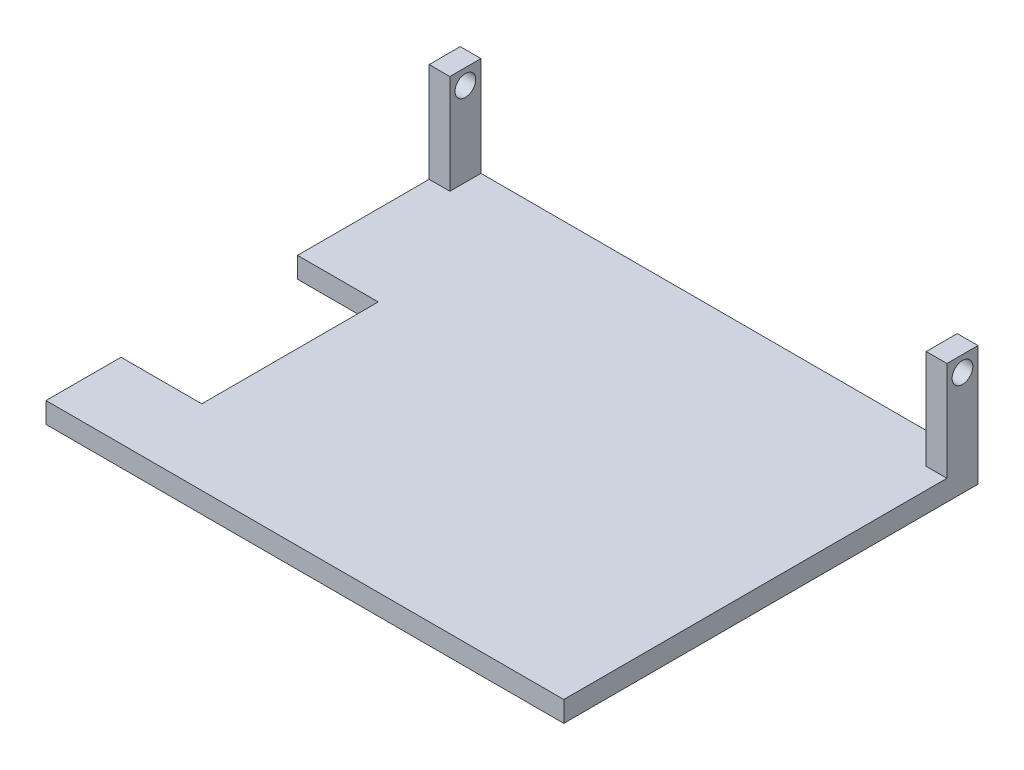
ISO-10303-21;
HEADER;
FILE_DESCRIPTION(('STEP AP214'),'2;1');
FILE_NAME('part.step','',(''),(''),'','','');
FILE_SCHEMA(('AUTOMOTIVE_DESIGN { 1 0 10303 214 1 1 1 1 }'));
ENDSEC;
DATA;
#1=APPLICATION_CONTEXT('core data for automotive mechanical design processes');
#2=APPLICATION_PROTOCOL_DEFINITION('international standard','automotive_design',2000,#1);
#3=PRODUCT_CONTEXT('',#1,'mechanical');
#4=PRODUCT('Part','Part','',(#3));
#5=PRODUCT_RELATED_PRODUCT_CATEGORY('part','',(#4));
#6=PRODUCT_DEFINITION_FORMATION('','',#4);
#7=PRODUCT_DEFINITION_CONTEXT('part definition',#1,'design');
#8=PRODUCT_DEFINITION('design','',#6,#7);
#9=PRODUCT_DEFINITION_SHAPE('','',#8);
#10=(LENGTH_UNIT() NAMED_UNIT(*) SI_UNIT(.MILLI.,.METRE.));
#11=(NAMED_UNIT(*) PLANE_ANGLE_UNIT() SI_UNIT($,.RADIAN.));
#12=(NAMED_UNIT(*) SI_UNIT($,.STERADIAN.) SOLID_ANGLE_UNIT());
#13=UNCERTAINTY_MEASURE_WITH_UNIT(LENGTH_MEASURE(1.E-05),#10,'distance_accuracy_value','');
#14=(GEOMETRIC_REPRESENTATION_CONTEXT(3) GLOBAL_UNCERTAINTY_ASSIGNED_CONTEXT((#13)) GLOBAL_UNIT_ASSIGNED_CONTEXT((#10,
#11,#12)) REPRESENTATION_CONTEXT('',''));
#15=CARTESIAN_POINT('',(0.,0.,0.));
#16=DIRECTION('',(0.,0.,1.));
#17=DIRECTION('',(1.,0.,0.));
#18=AXIS2_PLACEMENT_3D('',#15,#16,#17);
#19=CARTESIAN_POINT('',(-250.,10.,-185.));
#20=DIRECTION('',(0.,0.,1.));
#21=DIRECTION('',(1.,0.,0.));
#22=AXIS2_PLACEMENT_3D('',#19,#20,#21);
#23=PLANE('',#22);
#24=DIRECTION('',(0.,-1.,0.));
#25=VECTOR('',#24,1.);
#26=CARTESIAN_POINT('',(-240.,10.,-185.));
#27=LINE('',#26,#25);
#28=CARTESIAN_POINT('',(-240.,58.,-185.));
#29=VERTEX_POINT('',#28);
#30=CARTESIAN_POINT('',(-240.,10.,-185.));
#31=VERTEX_POINT('',#30);
#32=EDGE_CURVE('E142',#29,#31,#27,.T.);
#33=ORIENTED_EDGE('',*,*,#32,.F.);
#34=DIRECTION('',(1.,0.,0.));
#35=VECTOR('',#34,1.);
#36=CARTESIAN_POINT('',(-250.,58.,-185.));
#37=LINE('',#36,#35);
#38=CARTESIAN_POINT('',(-250.,58.,-185.));
#39=VERTEX_POINT('',#38);
#40=EDGE_CURVE('E180',#39,#29,#37,.T.);
#41=ORIENTED_EDGE('',*,*,#40,.F.);
#42=DIRECTION('',(0.,-1.,0.));
#43=VECTOR('',#42,1.);
#44=CARTESIAN_POINT('',(-250.,10.,-185.));
#45=LINE('',#44,#43);
#46=CARTESIAN_POINT('',(-250.,10.,-185.));
#47=VERTEX_POINT('',#46);
#48=EDGE_CURVE('E176',#39,#47,#45,.T.);
#49=ORIENTED_EDGE('',*,*,#48,.T.);
#50=DIRECTION('',(1.,0.,0.));
#51=VECTOR('',#50,1.);
#52=CARTESIAN_POINT('',(-250.,10.,-185.));
#53=LINE('',#52,#51);
#54=EDGE_CURVE('E58',#47,#31,#53,.T.);
#55=ORIENTED_EDGE('',*,*,#54,.T.);
#56=EDGE_LOOP('',(#33,#41,#49,#55));
#57=FACE_BOUND('',#56,.T.);
#58=ADVANCED_FACE('F33',(#57),#23,.T.);
#59=CARTESIAN_POINT('',(-250.,58.,-185.));
#60=DIRECTION('',(0.,1.,0.));
#61=DIRECTION('',(0.,0.,1.));
#62=AXIS2_PLACEMENT_3D('',#59,#60,#61);
#63=PLANE('',#62);
#64=DIRECTION('',(0.,0.,1.));
#65=VECTOR('',#64,1.);
#66=CARTESIAN_POINT('',(-240.,58.,-200.));
#67=LINE('',#66,#65);
#68=CARTESIAN_POINT('',(-240.,58.,-200.));
#69=VERTEX_POINT('',#68);
#70=EDGE_CURVE('E166',#69,#29,#67,.T.);
#71=ORIENTED_EDGE('',*,*,#70,.F.);
#72=DIRECTION('',(1.,0.,0.));
#73=VECTOR('',#72,1.);
#74=CARTESIAN_POINT('',(-250.,58.,-200.));
#75=LINE('',#74,#73);
#76=CARTESIAN_POINT('',(-250.,58.,-200.));
#77=VERTEX_POINT('',#76);
#78=EDGE_CURVE('E157',#77,#69,#75,.T.);
#79=ORIENTED_EDGE('',*,*,#78,.F.);
#80=DIRECTION('',(0.,0.,1.));
#81=VECTOR('',#80,1.);
#82=CARTESIAN_POINT('',(-250.,58.,-185.));
#83=LINE('',#82,#81);
#84=EDGE_CURVE('E172',#77,#39,#83,.T.);
#85=ORIENTED_EDGE('',*,*,#84,.T.);
#86=ORIENTED_EDGE('',*,*,#40,.T.);
#87=EDGE_LOOP('',(#71,#79,#85,#86));
#88=FACE_BOUND('',#87,.T.);
#89=ADVANCED_FACE('F288',(#88),#63,.T.);
#90=CARTESIAN_POINT('',(0.,10.,0.));
#91=DIRECTION('',(-1.,0.,0.));
#92=DIRECTION('',(0.,0.,1.));
#93=AXIS2_PLACEMENT_3D('',#90,#91,#92);
#94=PLANE('',#93);
#95=CARTESIAN_POINT('',(0.,50.5,-192.5));
#96=DIRECTION('',(1.,0.,0.));
#97=DIRECTION('',(0.,0.,-1.));
#98=AXIS2_PLACEMENT_3D('',#95,#96,#97);
#99=CIRCLE('',#98,4.99999999999999);
#100=CARTESIAN_POINT('',(0.,50.5,-197.5));
#101=VERTEX_POINT('',#100);
#102=EDGE_CURVE('E473',#101,#101,#99,.T.);
#103=ORIENTED_EDGE('',*,*,#102,.F.);
#104=EDGE_LOOP('',(#103));
#105=FACE_BOUND('',#104,.T.);
#106=DIRECTION('',(0.,0.,-1.));
#107=VECTOR('',#106,1.);
#108=CARTESIAN_POINT('',(0.,0.,0.));
#109=LINE('',#108,#107);
#110=CARTESIAN_POINT('',(0.,0.,0.));
#111=VERTEX_POINT('',#110);
#112=CARTESIAN_POINT('',(0.,0.,-200.));
#113=VERTEX_POINT('',#112);
#114=EDGE_CURVE('E183',#111,#113,#109,.T.);
#115=ORIENTED_EDGE('',*,*,#114,.T.);
#116=DIRECTION('',(0.,-1.,0.));
#117=VECTOR('',#116,1.);
#118=CARTESIAN_POINT('',(0.,10.,-200.));
#119=LINE('',#118,#117);
#120=CARTESIAN_POINT('',(0.,58.,-200.));
#121=VERTEX_POINT('',#120);
#122=EDGE_CURVE('E11',#121,#113,#119,.T.);
#123=ORIENTED_EDGE('',*,*,#122,.F.);
#124=DIRECTION('',(0.,0.,1.));
#125=VECTOR('',#124,1.);
#126=CARTESIAN_POINT('',(0.,58.,-185.));
#127=LINE('',#126,#125);
#128=CARTESIAN_POINT('',(0.,58.,-185.));
#129=VERTEX_POINT('',#128);
#130=EDGE_CURVE('E177',#121,#129,#127,.T.);
#131=ORIENTED_EDGE('',*,*,#130,.T.);
#132=DIRECTION('',(0.,-1.,0.));
#133=VECTOR('',#132,1.);
#134=CARTESIAN_POINT('',(0.,10.,-185.));
#135=LINE('',#134,#133);
#136=CARTESIAN_POINT('',(0.,10.,-185.));
#137=VERTEX_POINT('',#136);
#138=EDGE_CURVE('E168',#129,#137,#135,.T.);
#139=ORIENTED_EDGE('',*,*,#138,.T.);
#140=DIRECTION('',(0.,0.,-1.));
#141=VECTOR('',#140,1.);
#142=CARTESIAN_POINT('',(0.,10.,0.));
#143=LINE('',#142,#141);
#144=CARTESIAN_POINT('',(0.,10.,0.));
#145=VERTEX_POINT('',#144);
#146=EDGE_CURVE('E208',#145,#137,#143,.T.);
#147=ORIENTED_EDGE('',*,*,#146,.F.);
#148=DIRECTION('',(0.,-1.,0.));
#149=VECTOR('',#148,1.);
#150=CARTESIAN_POINT('',(0.,10.,0.));
#151=LINE('',#150,#149);
#152=EDGE_CURVE('E234',#145,#111,#151,.T.);
#153=ORIENTED_EDGE('',*,*,#152,.T.);
#154=EDGE_LOOP('',(#115,#123,#131,#139,#147,#153));
#155=FACE_BOUND('',#154,.T.);
#156=ADVANCED_FACE('F35',(#105,#155),#94,.F.);
#157=CARTESIAN_POINT('',(-250.,10.,-200.));
#158=DIRECTION('',(0.,0.,1.));
#159=DIRECTION('',(1.,0.,0.));
#160=AXIS2_PLACEMENT_3D('',#157,#158,#159);
#161=PLANE('',#160);
#162=ORIENTED_EDGE('',*,*,#78,.T.);
#163=DIRECTION('',(0.,-1.,0.));
#164=VECTOR('',#163,1.);
#165=CARTESIAN_POINT('',(-240.,10.,-200.));
#166=LINE('',#165,#164);
#167=CARTESIAN_POINT('',(-240.,10.,-200.));
#168=VERTEX_POINT('',#167);
#169=EDGE_CURVE('E139',#69,#168,#166,.T.);
#170=ORIENTED_EDGE('',*,*,#169,.T.);
#171=DIRECTION('',(1.,0.,0.));
#172=VECTOR('',#171,1.);
#173=CARTESIAN_POINT('',(-240.,10.,-200.));
#174=LINE('',#173,#172);
#175=CARTESIAN_POINT('',(-10.,10.,-200.));
#176=VERTEX_POINT('',#175);
#177=EDGE_CURVE('E147',#168,#176,#174,.T.);
#178=ORIENTED_EDGE('',*,*,#177,.T.);
#179=DIRECTION('',(0.,1.,0.));
#180=VECTOR('',#179,1.);
#181=CARTESIAN_POINT('',(-10.,10.,-200.));
#182=LINE('',#181,#180);
#183=CARTESIAN_POINT('',(-10.,58.,-200.));
#184=VERTEX_POINT('',#183);
#185=EDGE_CURVE('E144',#176,#184,#182,.T.);
#186=ORIENTED_EDGE('',*,*,#185,.T.);
#187=EDGE_CURVE('E186',#184,#121,#75,.T.);
#188=ORIENTED_EDGE('',*,*,#187,.T.);
#189=ORIENTED_EDGE('',*,*,#122,.T.);
#190=DIRECTION('',(-1.,0.,0.));
#191=VECTOR('',#190,1.);
#192=CARTESIAN_POINT('',(-250.,0.,-200.));
#193=LINE('',#192,#191);
#194=CARTESIAN_POINT('',(-250.,0.,-200.));
#195=VERTEX_POINT('',#194);
#196=EDGE_CURVE('E236',#113,#195,#193,.T.);
#197=ORIENTED_EDGE('',*,*,#196,.T.);
#198=DIRECTION('',(0.,-1.,0.));
#199=VECTOR('',#198,1.);
#200=CARTESIAN_POINT('',(-250.,10.,-200.));
#201=LINE('',#200,#199);
#202=EDGE_CURVE('E42',#77,#195,#201,.T.);
#203=ORIENTED_EDGE('',*,*,#202,.F.);
#204=EDGE_LOOP('',(#162,#170,#178,#186,#188,#189,#197,#203));
#205=FACE_BOUND('',#204,.T.);
#206=ADVANCED_FACE('F155',(#205),#161,.F.);
#207=CARTESIAN_POINT('',(-250.,10.,-121.442108628798));
#208=DIRECTION('',(1.,0.,0.));
#209=DIRECTION('',(0.,0.,-1.));
#210=AXIS2_PLACEMENT_3D('',#207,#208,#209);
#211=PLANE('',#210);
#212=CARTESIAN_POINT('',(-250.,50.5,-192.5));
#213=DIRECTION('',(1.,0.,0.));
#214=DIRECTION('',(0.,0.,-1.));
#215=AXIS2_PLACEMENT_3D('',#212,#213,#214);
#216=CIRCLE('',#215,4.99999999999999);
#217=CARTESIAN_POINT('',(-250.,50.5,-197.5));
#218=VERTEX_POINT('',#217);
#219=EDGE_CURVE('E468',#218,#218,#216,.T.);
#220=ORIENTED_EDGE('',*,*,#219,.T.);
#221=EDGE_LOOP('',(#220));
#222=FACE_BOUND('',#221,.T.);
#223=DIRECTION('',(0.,0.,1.));
#224=VECTOR('',#223,1.);
#225=CARTESIAN_POINT('',(-250.,0.,-121.442108628798));
#226=LINE('',#225,#224);
#227=CARTESIAN_POINT('',(-250.,0.,-121.442108628798));
#228=VERTEX_POINT('',#227);
#229=EDGE_CURVE('E238',#195,#228,#226,.T.);
#230=ORIENTED_EDGE('',*,*,#229,.T.);
#231=DIRECTION('',(0.,-1.,0.));
#232=VECTOR('',#231,1.);
#233=CARTESIAN_POINT('',(-250.,10.,-121.442108628798));
#234=LINE('',#233,#232);
#235=CARTESIAN_POINT('',(-250.,10.,-121.442108628798));
#236=VERTEX_POINT('',#235);
#237=EDGE_CURVE('E261',#236,#228,#234,.T.);
#238=ORIENTED_EDGE('',*,*,#237,.F.);
#239=DIRECTION('',(0.,0.,1.));
#240=VECTOR('',#239,1.);
#241=CARTESIAN_POINT('',(-250.,10.,-121.442108628798));
#242=LINE('',#241,#240);
#243=EDGE_CURVE('E217',#47,#236,#242,.T.);
#244=ORIENTED_EDGE('',*,*,#243,.F.);
#245=ORIENTED_EDGE('',*,*,#48,.F.);
#246=ORIENTED_EDGE('',*,*,#84,.F.);
#247=ORIENTED_EDGE('',*,*,#202,.T.);
#248=EDGE_LOOP('',(#230,#238,#244,#245,#246,#247));
#249=FACE_BOUND('',#248,.T.);
#250=ADVANCED_FACE('F267',(#222,#249),#211,.F.);
#251=CARTESIAN_POINT('',(-211.024769455164,10.,-121.442108628798));
#252=DIRECTION('',(0.,0.,-1.));
#253=DIRECTION('',(-1.,0.,0.));
#254=AXIS2_PLACEMENT_3D('',#251,#252,#253);
#255=PLANE('',#254);
#256=DIRECTION('',(1.,0.,0.));
#257=VECTOR('',#256,1.);
#258=CARTESIAN_POINT('',(-211.024769455164,0.,-121.442108628798));
#259=LINE('',#258,#257);
#260=CARTESIAN_POINT('',(-211.024769455164,0.,-121.442108628798));
#261=VERTEX_POINT('',#260);
#262=EDGE_CURVE('E240',#228,#261,#259,.T.);
#263=ORIENTED_EDGE('',*,*,#262,.T.);
#264=DIRECTION('',(0.,-1.,0.));
#265=VECTOR('',#264,1.);
#266=CARTESIAN_POINT('',(-211.024769455164,10.,-121.442108628798));
#267=LINE('',#266,#265);
#268=CARTESIAN_POINT('',(-211.024769455164,10.,-121.442108628798));
#269=VERTEX_POINT('',#268);
#270=EDGE_CURVE('E258',#269,#261,#267,.T.);
#271=ORIENTED_EDGE('',*,*,#270,.F.);
#272=DIRECTION('',(1.,0.,0.));
#273=VECTOR('',#272,1.);
#274=CARTESIAN_POINT('',(-211.024769455164,10.,-121.442108628798));
#275=LINE('',#274,#273);
#276=EDGE_CURVE('E220',#236,#269,#275,.T.);
#277=ORIENTED_EDGE('',*,*,#276,.F.);
#278=ORIENTED_EDGE('',*,*,#237,.T.);
#279=EDGE_LOOP('',(#263,#271,#277,#278));
#280=FACE_BOUND('',#279,.T.);
#281=ADVANCED_FACE('F278',(#280),#255,.F.);
#282=CARTESIAN_POINT('',(-211.024769455164,10.,-36.2288806967684));
#283=DIRECTION('',(1.,0.,0.));
#284=DIRECTION('',(0.,0.,-1.));
#285=AXIS2_PLACEMENT_3D('',#282,#283,#284);
#286=PLANE('',#285);
#287=DIRECTION('',(0.,0.,1.));
#288=VECTOR('',#287,1.);
#289=CARTESIAN_POINT('',(-211.024769455164,0.,-36.2288806967684));
#290=LINE('',#289,#288);
#291=CARTESIAN_POINT('',(-211.024769455164,0.,-36.2288806967684));
#292=VERTEX_POINT('',#291);
#293=EDGE_CURVE('E242',#261,#292,#290,.T.);
#294=ORIENTED_EDGE('',*,*,#293,.T.);
#295=DIRECTION('',(0.,-1.,0.));
#296=VECTOR('',#295,1.);
#297=CARTESIAN_POINT('',(-211.024769455164,10.,-36.2288806967684));
#298=LINE('',#297,#296);
#299=CARTESIAN_POINT('',(-211.024769455164,10.,-36.2288806967684));
#300=VERTEX_POINT('',#299);
#301=EDGE_CURVE('E255',#300,#292,#298,.T.);
#302=ORIENTED_EDGE('',*,*,#301,.F.);
#303=DIRECTION('',(0.,0.,1.));
#304=VECTOR('',#303,1.);
#305=CARTESIAN_POINT('',(-211.024769455164,10.,-36.2288806967684));
#306=LINE('',#305,#304);
#307=EDGE_CURVE('E227',#269,#300,#306,.T.);
#308=ORIENTED_EDGE('',*,*,#307,.F.);
#309=ORIENTED_EDGE('',*,*,#270,.T.);
#310=EDGE_LOOP('',(#294,#302,#308,#309));
#311=FACE_BOUND('',#310,.T.);
#312=ADVANCED_FACE('F282',(#311),#286,.F.);
#313=CARTESIAN_POINT('',(-250.,10.,-36.2288806967684));
#314=DIRECTION('',(0.,0.,1.));
#315=DIRECTION('',(1.,0.,0.));
#316=AXIS2_PLACEMENT_3D('',#313,#314,#315);
#317=PLANE('',#316);
#318=DIRECTION('',(-1.,0.,0.));
#319=VECTOR('',#318,1.);
#320=CARTESIAN_POINT('',(-250.,0.,-36.2288806967684));
#321=LINE('',#320,#319);
#322=CARTESIAN_POINT('',(-250.,0.,-36.2288806967684));
#323=VERTEX_POINT('',#322);
#324=EDGE_CURVE('E244',#292,#323,#321,.T.);
#325=ORIENTED_EDGE('',*,*,#324,.T.);
#326=DIRECTION('',(0.,-1.,0.));
#327=VECTOR('',#326,1.);
#328=CARTESIAN_POINT('',(-250.,10.,-36.2288806967684));
#329=LINE('',#328,#327);
#330=CARTESIAN_POINT('',(-250.,10.,-36.2288806967684));
#331=VERTEX_POINT('',#330);
#332=EDGE_CURVE('E252',#331,#323,#329,.T.);
#333=ORIENTED_EDGE('',*,*,#332,.F.);
#334=DIRECTION('',(-1.,0.,0.));
#335=VECTOR('',#334,1.);
#336=CARTESIAN_POINT('',(-250.,10.,-36.2288806967684));
#337=LINE('',#336,#335);
#338=EDGE_CURVE('E229',#300,#331,#337,.T.);
#339=ORIENTED_EDGE('',*,*,#338,.F.);
#340=ORIENTED_EDGE('',*,*,#301,.T.);
#341=EDGE_LOOP('',(#325,#333,#339,#340));
#342=FACE_BOUND('',#341,.T.);
#343=ADVANCED_FACE('F322',(#342),#317,.F.);
#344=CARTESIAN_POINT('',(-250.,10.,0.));
#345=DIRECTION('',(1.,0.,0.));
#346=DIRECTION('',(0.,0.,-1.));
#347=AXIS2_PLACEMENT_3D('',#344,#345,#346);
#348=PLANE('',#347);
#349=DIRECTION('',(0.,0.,1.));
#350=VECTOR('',#349,1.);
#351=CARTESIAN_POINT('',(-250.,0.,0.));
#352=LINE('',#351,#350);
#353=CARTESIAN_POINT('',(-250.,0.,0.));
#354=VERTEX_POINT('',#353);
#355=EDGE_CURVE('E221',#323,#354,#352,.T.);
#356=ORIENTED_EDGE('',*,*,#355,.T.);
#357=DIRECTION('',(0.,-1.,0.));
#358=VECTOR('',#357,1.);
#359=CARTESIAN_POINT('',(-250.,10.,0.));
#360=LINE('',#359,#358);
#361=CARTESIAN_POINT('',(-250.,10.,0.));
#362=VERTEX_POINT('',#361);
#363=EDGE_CURVE('E249',#362,#354,#360,.T.);
#364=ORIENTED_EDGE('',*,*,#363,.F.);
#365=DIRECTION('',(0.,0.,1.));
#366=VECTOR('',#365,1.);
#367=CARTESIAN_POINT('',(-250.,10.,0.));
#368=LINE('',#367,#366);
#369=EDGE_CURVE('E231',#331,#362,#368,.T.);
#370=ORIENTED_EDGE('',*,*,#369,.F.);
#371=ORIENTED_EDGE('',*,*,#332,.T.);
#372=EDGE_LOOP('',(#356,#364,#370,#371));
#373=FACE_BOUND('',#372,.T.);
#374=ADVANCED_FACE('F312',(#373),#348,.F.);
#375=CARTESIAN_POINT('',(0.,10.,0.));
#376=DIRECTION('',(0.,0.,-1.));
#377=DIRECTION('',(-1.,0.,0.));
#378=AXIS2_PLACEMENT_3D('',#375,#376,#377);
#379=PLANE('',#378);
#380=DIRECTION('',(1.,0.,0.));
#381=VECTOR('',#380,1.);
#382=CARTESIAN_POINT('',(0.,0.,0.));
#383=LINE('',#382,#381);
#384=EDGE_CURVE('E218',#354,#111,#383,.T.);
#385=ORIENTED_EDGE('',*,*,#384,.T.);
#386=ORIENTED_EDGE('',*,*,#152,.F.);
#387=DIRECTION('',(1.,0.,0.));
#388=VECTOR('',#387,1.);
#389=CARTESIAN_POINT('',(-210.,10.,0.));
#390=LINE('',#389,#388);
#391=EDGE_CURVE('E215',#362,#145,#390,.T.);
#392=ORIENTED_EDGE('',*,*,#391,.F.);
#393=ORIENTED_EDGE('',*,*,#363,.T.);
#394=EDGE_LOOP('',(#385,#386,#392,#393));
#395=FACE_BOUND('',#394,.T.);
#396=ADVANCED_FACE('F314',(#395),#379,.F.);
#397=CARTESIAN_POINT('',(0.,10.,0.));
#398=DIRECTION('',(0.,1.,0.));
#399=DIRECTION('',(0.,0.,1.));
#400=AXIS2_PLACEMENT_3D('',#397,#398,#399);
#401=PLANE('',#400);
#402=ORIENTED_EDGE('',*,*,#54,.F.);
#403=ORIENTED_EDGE('',*,*,#243,.T.);
#404=ORIENTED_EDGE('',*,*,#276,.T.);
#405=ORIENTED_EDGE('',*,*,#307,.T.);
#406=ORIENTED_EDGE('',*,*,#338,.T.);
#407=ORIENTED_EDGE('',*,*,#369,.T.);
#408=ORIENTED_EDGE('',*,*,#391,.T.);
#409=ORIENTED_EDGE('',*,*,#146,.T.);
#410=CARTESIAN_POINT('',(-10.,10.,-185.));
#411=VERTEX_POINT('',#410);
#412=EDGE_CURVE('E175',#411,#137,#53,.T.);
#413=ORIENTED_EDGE('',*,*,#412,.F.);
#414=DIRECTION('',(0.,0.,1.));
#415=VECTOR('',#414,1.);
#416=CARTESIAN_POINT('',(-10.,10.,-200.));
#417=LINE('',#416,#415);
#418=EDGE_CURVE('E143',#176,#411,#417,.T.);
#419=ORIENTED_EDGE('',*,*,#418,.F.);
#420=ORIENTED_EDGE('',*,*,#177,.F.);
#421=DIRECTION('',(0.,0.,1.));
#422=VECTOR('',#421,1.);
#423=CARTESIAN_POINT('',(-240.,10.,-200.));
#424=LINE('',#423,#422);
#425=EDGE_CURVE('E135',#168,#31,#424,.T.);
#426=ORIENTED_EDGE('',*,*,#425,.T.);
#427=EDGE_LOOP('',(#402,#403,#404,#405,#406,#407,#408,#409,#413,#419,#420,#426));
#428=FACE_BOUND('',#427,.T.);
#429=ADVANCED_FACE('F148',(#428),#401,.T.);
#430=CARTESIAN_POINT('',(0.,0.,0.));
#431=DIRECTION('',(0.,1.,0.));
#432=DIRECTION('',(0.,0.,1.));
#433=AXIS2_PLACEMENT_3D('',#430,#431,#432);
#434=PLANE('',#433);
#435=ORIENTED_EDGE('',*,*,#114,.F.);
#436=ORIENTED_EDGE('',*,*,#384,.F.);
#437=ORIENTED_EDGE('',*,*,#355,.F.);
#438=ORIENTED_EDGE('',*,*,#324,.F.);
#439=ORIENTED_EDGE('',*,*,#293,.F.);
#440=ORIENTED_EDGE('',*,*,#262,.F.);
#441=ORIENTED_EDGE('',*,*,#229,.F.);
#442=ORIENTED_EDGE('',*,*,#196,.F.);
#443=EDGE_LOOP('',(#435,#436,#437,#438,#439,#440,#441,#442));
#444=FACE_BOUND('',#443,.T.);
#445=ADVANCED_FACE('F273',(#444),#434,.F.);
#446=DIRECTION('',(0.,1.,0.));
#447=VECTOR('',#446,1.);
#448=CARTESIAN_POINT('',(-10.,10.,-185.));
#449=LINE('',#448,#447);
#450=CARTESIAN_POINT('',(-10.,58.,-185.));
#451=VERTEX_POINT('',#450);
#452=EDGE_CURVE('E50',#411,#451,#449,.T.);
#453=ORIENTED_EDGE('',*,*,#452,.F.);
#454=ORIENTED_EDGE('',*,*,#412,.T.);
#455=ORIENTED_EDGE('',*,*,#138,.F.);
#456=EDGE_CURVE('E184',#451,#129,#37,.T.);
#457=ORIENTED_EDGE('',*,*,#456,.F.);
#458=EDGE_LOOP('',(#453,#454,#455,#457));
#459=FACE_BOUND('',#458,.T.);
#460=ADVANCED_FACE('F213',(#459),#23,.T.);
#461=DIRECTION('',(0.,0.,1.));
#462=VECTOR('',#461,1.);
#463=CARTESIAN_POINT('',(-10.,58.,-200.));
#464=LINE('',#463,#462);
#465=EDGE_CURVE('E169',#184,#451,#464,.T.);
#466=ORIENTED_EDGE('',*,*,#465,.T.);
#467=ORIENTED_EDGE('',*,*,#456,.T.);
#468=ORIENTED_EDGE('',*,*,#130,.F.);
#469=ORIENTED_EDGE('',*,*,#187,.F.);
#470=EDGE_LOOP('',(#466,#467,#468,#469));
#471=FACE_BOUND('',#470,.T.);
#472=ADVANCED_FACE('F291',(#471),#63,.T.);
#473=CARTESIAN_POINT('',(-240.,10.,-200.));
#474=DIRECTION('',(-1.,0.,0.));
#475=DIRECTION('',(0.,0.,1.));
#476=AXIS2_PLACEMENT_3D('',#473,#474,#475);
#477=PLANE('',#476);
#478=CARTESIAN_POINT('',(-240.,50.5,-192.5));
#479=DIRECTION('',(-1.,0.,0.));
#480=DIRECTION('',(0.,0.,1.));
#481=AXIS2_PLACEMENT_3D('',#478,#479,#480);
#482=CIRCLE('',#481,4.99999999999999);
#483=CARTESIAN_POINT('',(-240.,50.5,-187.5));
#484=VERTEX_POINT('',#483);
#485=EDGE_CURVE('E161',#484,#484,#482,.T.);
#486=ORIENTED_EDGE('',*,*,#485,.T.);
#487=EDGE_LOOP('',(#486));
#488=FACE_BOUND('',#487,.T.);
#489=ORIENTED_EDGE('',*,*,#32,.T.);
#490=ORIENTED_EDGE('',*,*,#425,.F.);
#491=ORIENTED_EDGE('',*,*,#169,.F.);
#492=ORIENTED_EDGE('',*,*,#70,.T.);
#493=EDGE_LOOP('',(#489,#490,#491,#492));
#494=FACE_BOUND('',#493,.T.);
#495=ADVANCED_FACE('F137',(#488,#494),#477,.F.);
#496=CARTESIAN_POINT('',(-10.,10.,-200.));
#497=DIRECTION('',(1.,0.,0.));
#498=DIRECTION('',(0.,0.,-1.));
#499=AXIS2_PLACEMENT_3D('',#496,#497,#498);
#500=PLANE('',#499);
#501=CARTESIAN_POINT('',(-10.,50.5,-192.5));
#502=DIRECTION('',(1.,0.,0.));
#503=DIRECTION('',(0.,0.,-1.));
#504=AXIS2_PLACEMENT_3D('',#501,#502,#503);
#505=CIRCLE('',#504,4.99999999999999);
#506=CARTESIAN_POINT('',(-10.,50.5,-197.5));
#507=VERTEX_POINT('',#506);
#508=EDGE_CURVE('E37',#507,#507,#505,.T.);
#509=ORIENTED_EDGE('',*,*,#508,.T.);
#510=EDGE_LOOP('',(#509));
#511=FACE_BOUND('',#510,.T.);
#512=ORIENTED_EDGE('',*,*,#452,.T.);
#513=ORIENTED_EDGE('',*,*,#465,.F.);
#514=ORIENTED_EDGE('',*,*,#185,.F.);
#515=ORIENTED_EDGE('',*,*,#418,.T.);
#516=EDGE_LOOP('',(#512,#513,#514,#515));
#517=FACE_BOUND('',#516,.T.);
#518=ADVANCED_FACE('F305',(#511,#517),#500,.F.);
#519=CARTESIAN_POINT('',(-250.,50.5,-192.5));
#520=DIRECTION('',(1.,0.,0.));
#521=DIRECTION('',(0.,0.,-1.));
#522=AXIS2_PLACEMENT_3D('',#519,#520,#521);
#523=CYLINDRICAL_SURFACE('',#522,4.99999999999999);
#524=ORIENTED_EDGE('',*,*,#102,.T.);
#525=EDGE_LOOP('',(#524));
#526=FACE_BOUND('',#525,.T.);
#527=ORIENTED_EDGE('',*,*,#508,.F.);
#528=EDGE_LOOP('',(#527));
#529=FACE_BOUND('',#528,.T.);
#530=ADVANCED_FACE('F442',(#526,#529),#523,.F.);
#531=ORIENTED_EDGE('',*,*,#219,.F.);
#532=EDGE_LOOP('',(#531));
#533=FACE_BOUND('',#532,.T.);
#534=ORIENTED_EDGE('',*,*,#485,.F.);
#535=EDGE_LOOP('',(#534));
#536=FACE_BOUND('',#535,.T.);
#537=ADVANCED_FACE('F451',(#533,#536),#523,.F.);
#538=CLOSED_SHELL('',(#58,#89,#156,#206,#250,#281,#312,#343,#374,#396,#429,#445,#460,#472,#495,
#518,#530,#537));
#539=MANIFOLD_SOLID_BREP('B2',#538);
#540=ADVANCED_BREP_SHAPE_REPRESENTATION('',(#18,#539),#14);
#541=SHAPE_DEFINITION_REPRESENTATION(#9,#540);
ENDSEC;
END-ISO-10303-21;
